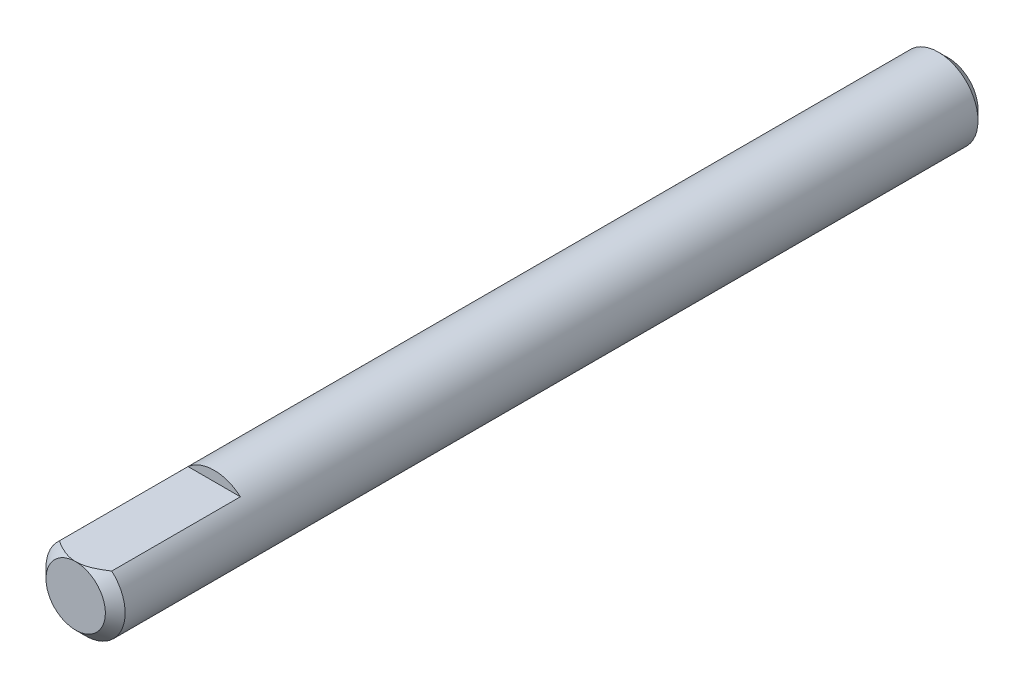
ISO-10303-21;
HEADER;
FILE_DESCRIPTION(('STEP AP214'),'2;1');
FILE_NAME('part.step','',(''),(''),'','','');
FILE_SCHEMA(('AUTOMOTIVE_DESIGN { 1 0 10303 214 1 1 1 1 }'));
ENDSEC;
DATA;
#1=APPLICATION_CONTEXT('core data for automotive mechanical design processes');
#2=APPLICATION_PROTOCOL_DEFINITION('international standard','automotive_design',2000,#1);
#3=PRODUCT_CONTEXT('',#1,'mechanical');
#4=PRODUCT('Part','Part','',(#3));
#5=PRODUCT_RELATED_PRODUCT_CATEGORY('part','',(#4));
#6=PRODUCT_DEFINITION_FORMATION('','',#4);
#7=PRODUCT_DEFINITION_CONTEXT('part definition',#1,'design');
#8=PRODUCT_DEFINITION('design','',#6,#7);
#9=PRODUCT_DEFINITION_SHAPE('','',#8);
#10=(LENGTH_UNIT() NAMED_UNIT(*) SI_UNIT(.MILLI.,.METRE.));
#11=(NAMED_UNIT(*) PLANE_ANGLE_UNIT() SI_UNIT($,.RADIAN.));
#12=(NAMED_UNIT(*) SI_UNIT($,.STERADIAN.) SOLID_ANGLE_UNIT());
#13=UNCERTAINTY_MEASURE_WITH_UNIT(LENGTH_MEASURE(1.E-05),#10,'distance_accuracy_value','');
#14=(GEOMETRIC_REPRESENTATION_CONTEXT(3) GLOBAL_UNCERTAINTY_ASSIGNED_CONTEXT((#13)) GLOBAL_UNIT_ASSIGNED_CONTEXT((#10,
#11,#12)) REPRESENTATION_CONTEXT('',''));
#15=CARTESIAN_POINT('',(0.,0.,0.));
#16=DIRECTION('',(0.,0.,1.));
#17=DIRECTION('',(1.,0.,0.));
#18=AXIS2_PLACEMENT_3D('',#15,#16,#17);
#19=CARTESIAN_POINT('',(0.,0.,44.1));
#20=DIRECTION('',(0.,0.,-1.));
#21=DIRECTION('',(-1.,0.,0.));
#22=AXIS2_PLACEMENT_3D('',#19,#20,#21);
#23=CYLINDRICAL_SURFACE('',#22,2.);
#24=CARTESIAN_POINT('',(0.,0.,0.5));
#25=DIRECTION('',(0.,0.,1.));
#26=DIRECTION('',(1.,0.,0.));
#27=AXIS2_PLACEMENT_3D('',#24,#25,#26);
#28=CIRCLE('',#27,2.);
#29=CARTESIAN_POINT('',(2.,0.,0.5));
#30=VERTEX_POINT('',#29);
#31=EDGE_CURVE('E79',#30,#30,#28,.T.);
#32=ORIENTED_EDGE('',*,*,#31,.T.);
#33=EDGE_LOOP('',(#32));
#34=FACE_BOUND('',#33,.T.);
#35=DIRECTION('',(0.,0.,1.));
#36=VECTOR('',#35,1.);
#37=CARTESIAN_POINT('',(1.3228756555323,1.5,37.1));
#38=LINE('',#37,#36);
#39=CARTESIAN_POINT('',(1.3228756555323,1.5,37.1));
#40=VERTEX_POINT('',#39);
#41=CARTESIAN_POINT('',(1.3228756555323,1.5,43.6));
#42=VERTEX_POINT('',#41);
#43=EDGE_CURVE('E76',#40,#42,#38,.T.);
#44=ORIENTED_EDGE('',*,*,#43,.T.);
#45=CARTESIAN_POINT('',(0.,0.,43.6));
#46=DIRECTION('',(0.,0.,1.));
#47=DIRECTION('',(1.,0.,0.));
#48=AXIS2_PLACEMENT_3D('',#45,#46,#47);
#49=CIRCLE('',#48,2.);
#50=CARTESIAN_POINT('',(-1.3228756555323,1.5,43.6));
#51=VERTEX_POINT('',#50);
#52=EDGE_CURVE('E11',#42,#51,#49,.F.);
#53=ORIENTED_EDGE('',*,*,#52,.T.);
#54=DIRECTION('',(0.,0.,1.));
#55=VECTOR('',#54,1.);
#56=CARTESIAN_POINT('',(-1.3228756555323,1.5,37.1));
#57=LINE('',#56,#55);
#58=CARTESIAN_POINT('',(-1.3228756555323,1.5,37.1));
#59=VERTEX_POINT('',#58);
#60=EDGE_CURVE('E74',#59,#51,#57,.T.);
#61=ORIENTED_EDGE('',*,*,#60,.F.);
#62=CARTESIAN_POINT('',(0.,0.,37.1));
#63=DIRECTION('',(0.,0.,1.));
#64=DIRECTION('',(1.,0.,0.));
#65=AXIS2_PLACEMENT_3D('',#62,#63,#64);
#66=CIRCLE('',#65,2.);
#67=EDGE_CURVE('E68',#40,#59,#66,.T.);
#68=ORIENTED_EDGE('',*,*,#67,.F.);
#69=EDGE_LOOP('',(#44,#53,#61,#68));
#70=FACE_BOUND('',#69,.T.);
#71=ADVANCED_FACE('F37',(#34,#70),#23,.T.);
#72=CARTESIAN_POINT('',(0.,0.,44.1));
#73=DIRECTION('',(0.,0.,1.));
#74=DIRECTION('',(1.,0.,0.));
#75=AXIS2_PLACEMENT_3D('',#72,#73,#74);
#76=PLANE('',#75);
#77=CARTESIAN_POINT('',(0.,0.,44.1));
#78=DIRECTION('',(0.,0.,1.));
#79=DIRECTION('',(1.,0.,0.));
#80=AXIS2_PLACEMENT_3D('',#77,#78,#79);
#81=CIRCLE('',#80,1.50000000000002);
#82=CARTESIAN_POINT('',(0.,1.5,44.1));
#83=VERTEX_POINT('',#82);
#84=EDGE_CURVE('E87',#83,#83,#81,.T.);
#85=ORIENTED_EDGE('',*,*,#84,.T.);
#86=EDGE_LOOP('',(#85));
#87=FACE_BOUND('',#86,.T.);
#88=ADVANCED_FACE('F103',(#87),#76,.T.);
#89=CARTESIAN_POINT('',(0.,0.,0.));
#90=DIRECTION('',(0.,0.,1.));
#91=DIRECTION('',(1.,0.,0.));
#92=AXIS2_PLACEMENT_3D('',#89,#90,#91);
#93=PLANE('',#92);
#94=CARTESIAN_POINT('',(0.,0.,0.));
#95=DIRECTION('',(0.,0.,1.));
#96=DIRECTION('',(1.,0.,0.));
#97=AXIS2_PLACEMENT_3D('',#94,#95,#96);
#98=CIRCLE('',#97,1.5);
#99=CARTESIAN_POINT('',(1.5,0.,0.));
#100=VERTEX_POINT('',#99);
#101=EDGE_CURVE('E84',#100,#100,#98,.F.);
#102=ORIENTED_EDGE('',*,*,#101,.T.);
#103=EDGE_LOOP('',(#102));
#104=FACE_BOUND('',#103,.T.);
#105=ADVANCED_FACE('F102',(#104),#93,.F.);
#106=CARTESIAN_POINT('',(1.3228756555323,1.5,37.1));
#107=DIRECTION('',(0.,-1.,0.));
#108=DIRECTION('',(0.,0.,-1.));
#109=AXIS2_PLACEMENT_3D('',#106,#107,#108);
#110=PLANE('',#109);
#111=CARTESIAN_POINT('',(-1.3228756555323,1.5,43.6));
#112=CARTESIAN_POINT('',(-1.28978652612197,1.5,43.6218833857545));
#113=CARTESIAN_POINT('',(-1.25648829910181,1.5,43.6434496498551));
#114=CARTESIAN_POINT('',(-1.18940821726434,1.5,43.6858385594099));
#115=CARTESIAN_POINT('',(-1.15562621830027,1.5,43.7066609764822));
#116=CARTESIAN_POINT('',(-1.05313237355708,1.5,43.7680407619983));
#117=CARTESIAN_POINT('',(-0.98361601607946,1.5,43.8072803573742));
#118=CARTESIAN_POINT('',(-0.844330882585121,1.5,43.8796887527596));
#119=CARTESIAN_POINT('',(-0.774644168937836,1.5,43.9130137248863));
#120=CARTESIAN_POINT('',(-0.632661487183351,1.5,43.9733011447232));
#121=CARTESIAN_POINT('',(-0.560371516974689,1.5,44.0002772585623));
#122=CARTESIAN_POINT('',(-0.447711355257236,1.5,44.0350506591265));
#123=CARTESIAN_POINT('',(-0.408281760395013,1.5,44.0459074152516));
#124=CARTESIAN_POINT('',(-0.328766084069401,1.5,44.0648791696628));
#125=CARTESIAN_POINT('',(-0.288680112516291,1.5,44.0729946221558));
#126=CARTESIAN_POINT('',(-0.20733704073992,1.5,44.0862763839652));
#127=CARTESIAN_POINT('',(-0.166071526804487,1.5,44.0913918975478));
#128=CARTESIAN_POINT('',(-0.083209108028721,1.5,44.0982691223499));
#129=CARTESIAN_POINT('',(-0.0416118354951801,1.5,44.1000263649074));
#130=CARTESIAN_POINT('',(0.,1.5,44.1));
#131=B_SPLINE_CURVE_WITH_KNOTS('',3,(#111,#112,#113,#114,#115,#116,#117,#118,#119,#120,#121,
#122,#123,#124,#125,#126,#127,#128,#129,#130),.UNSPECIFIED.,.F.,.F.,(4,2,2,2,2,2,2,2,2,4),(0.,
0.119008015794696,0.23805226170176,0.477379838956318,0.708907622255366,0.939932380523272,
1.06254219805099,1.18513169036961,1.30974106784378,1.43451614086004),.UNSPECIFIED.);
#132=EDGE_CURVE('E90',#51,#83,#131,.T.);
#133=ORIENTED_EDGE('',*,*,#132,.T.);
#134=CARTESIAN_POINT('',(0.,1.50000000000002,44.1));
#135=CARTESIAN_POINT('',(0.0461370153411524,1.50000000000001,44.1000386607205));
#136=CARTESIAN_POINT('',(0.0922502054811595,1.5,44.0978722597569));
#137=CARTESIAN_POINT('',(0.184012446607612,1.5,44.0894344397993));
#138=CARTESIAN_POINT('',(0.229662229086186,1.5,44.0831710594088));
#139=CARTESIAN_POINT('',(0.31948378925482,1.5,44.0669828571131));
#140=CARTESIAN_POINT('',(0.363667480994447,1.5,44.0571229726859));
#141=CARTESIAN_POINT('',(0.451194895226753,1.5,44.0341794397452));
#142=CARTESIAN_POINT('',(0.494538298889032,1.5,44.0210945924438));
#143=CARTESIAN_POINT('',(0.606395493957555,1.5,43.9833699128523));
#144=CARTESIAN_POINT('',(0.674171065761261,1.5,43.9565447061522));
#145=CARTESIAN_POINT('',(0.807413522295389,1.5,43.8975484094862));
#146=CARTESIAN_POINT('',(0.872876793005125,1.5,43.8653693642066));
#147=CARTESIAN_POINT('',(1.00366784628293,1.5,43.7960693225406));
#148=CARTESIAN_POINT('',(1.06893080509668,1.5,43.7588276799215));
#149=CARTESIAN_POINT('',(1.19733148575674,1.5,43.6813925116698));
#150=CARTESIAN_POINT('',(1.2604767377164,1.5,43.6412115385309));
#151=CARTESIAN_POINT('',(1.3228756555323,1.5,43.6));
#152=B_SPLINE_CURVE_WITH_KNOTS('',3,(#134,#135,#136,#137,#138,#139,#140,#141,#142,#143,#144,
#145,#146,#147,#148,#149,#150,#151),.UNSPECIFIED.,.F.,.F.,(4,2,2,2,2,2,2,2,4),(0.,
0.138322115291913,0.276373642272272,0.412046847194111,0.547770561022341,0.766109415073269,
0.984775646595174,1.21010028779064,1.43451329838993),.UNSPECIFIED.);
#153=EDGE_CURVE('E46',#83,#42,#152,.T.);
#154=ORIENTED_EDGE('',*,*,#153,.T.);
#155=ORIENTED_EDGE('',*,*,#43,.F.);
#156=DIRECTION('',(1.,0.,0.));
#157=VECTOR('',#156,1.);
#158=CARTESIAN_POINT('',(1.3228756555323,1.5,37.1));
#159=LINE('',#158,#157);
#160=EDGE_CURVE('E71',#59,#40,#159,.T.);
#161=ORIENTED_EDGE('',*,*,#160,.F.);
#162=ORIENTED_EDGE('',*,*,#60,.T.);
#163=EDGE_LOOP('',(#133,#154,#155,#161,#162));
#164=FACE_BOUND('',#163,.T.);
#165=ADVANCED_FACE('F73',(#164),#110,.F.);
#166=CARTESIAN_POINT('',(0.,0.,37.1));
#167=DIRECTION('',(0.,0.,1.));
#168=DIRECTION('',(1.,0.,0.));
#169=AXIS2_PLACEMENT_3D('',#166,#167,#168);
#170=PLANE('',#169);
#171=ORIENTED_EDGE('',*,*,#67,.T.);
#172=ORIENTED_EDGE('',*,*,#160,.T.);
#173=EDGE_LOOP('',(#171,#172));
#174=FACE_BOUND('',#173,.T.);
#175=ADVANCED_FACE('F70',(#174),#170,.T.);
#176=CARTESIAN_POINT('',(0.,0.,0.5));
#177=DIRECTION('',(0.,0.,1.));
#178=DIRECTION('',(1.,0.,0.));
#179=AXIS2_PLACEMENT_3D('',#176,#177,#178);
#180=CONICAL_SURFACE('',#179,2.,0.785398163397447);
#181=ORIENTED_EDGE('',*,*,#101,.F.);
#182=EDGE_LOOP('',(#181));
#183=FACE_BOUND('',#182,.T.);
#184=ORIENTED_EDGE('',*,*,#31,.F.);
#185=EDGE_LOOP('',(#184));
#186=FACE_BOUND('',#185,.T.);
#187=ADVANCED_FACE('F113',(#183,#186),#180,.T.);
#188=CARTESIAN_POINT('',(0.,0.,44.1));
#189=DIRECTION('',(0.,0.,-1.));
#190=DIRECTION('',(-1.,0.,0.));
#191=AXIS2_PLACEMENT_3D('',#188,#189,#190);
#192=CONICAL_SURFACE('',#191,1.50000000000002,0.78539816339744);
#193=ORIENTED_EDGE('',*,*,#132,.F.);
#194=ORIENTED_EDGE('',*,*,#52,.F.);
#195=ORIENTED_EDGE('',*,*,#153,.F.);
#196=ORIENTED_EDGE('',*,*,#84,.F.);
#197=EDGE_LOOP('',(#193,#194,#195,#196));
#198=FACE_BOUND('',#197,.T.);
#199=ADVANCED_FACE('F39',(#198),#192,.T.);
#200=CLOSED_SHELL('',(#71,#88,#105,#165,#175,#187,#199));
#201=MANIFOLD_SOLID_BREP('B2',#200);
#202=ADVANCED_BREP_SHAPE_REPRESENTATION('',(#18,#201),#14);
#203=SHAPE_DEFINITION_REPRESENTATION(#9,#202);
ENDSEC;
END-ISO-10303-21;
